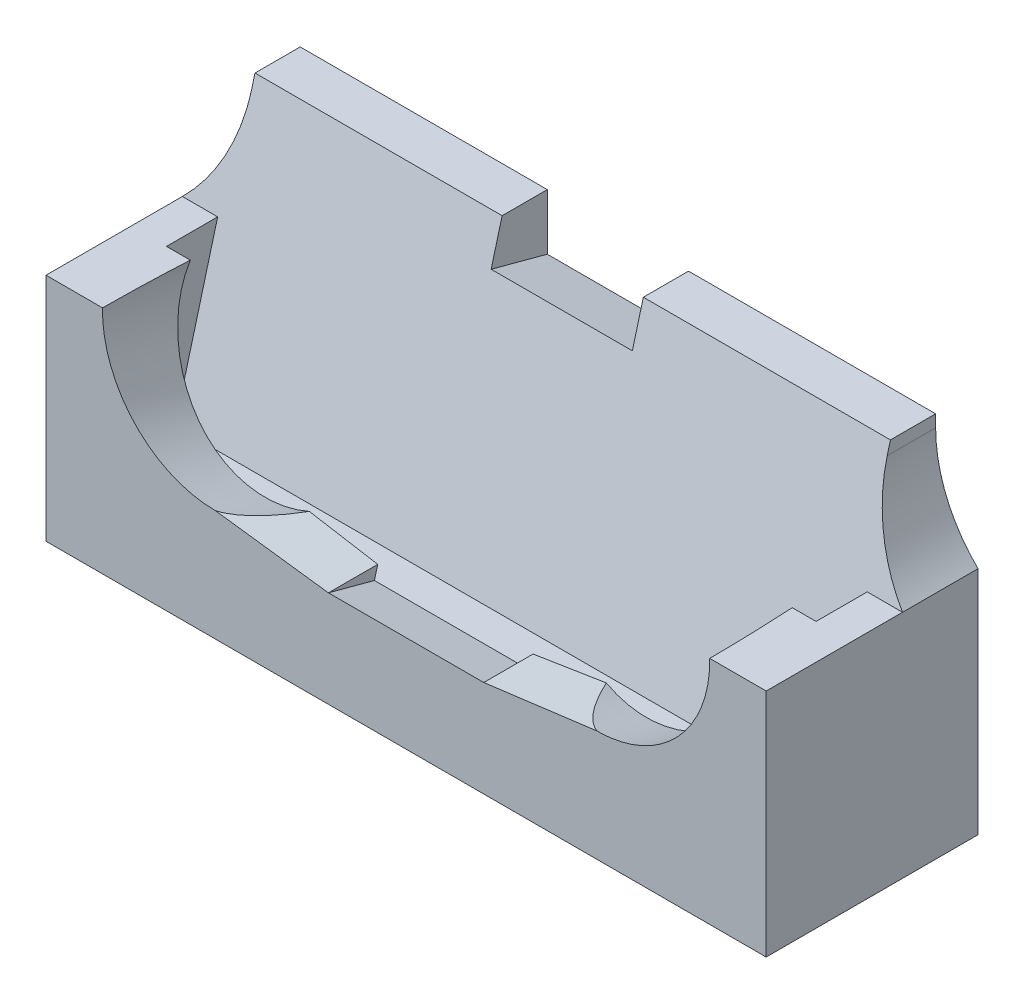
ISO-10303-21;
HEADER;
FILE_DESCRIPTION(('STEP AP214'),'2;1');
FILE_NAME('part.step','',(''),(''),'','','');
FILE_SCHEMA(('AUTOMOTIVE_DESIGN { 1 0 10303 214 1 1 1 1 }'));
ENDSEC;
DATA;
#1=APPLICATION_CONTEXT('core data for automotive mechanical design processes');
#2=APPLICATION_PROTOCOL_DEFINITION('international standard','automotive_design',2000,#1);
#3=PRODUCT_CONTEXT('',#1,'mechanical');
#4=PRODUCT('Part','Part','',(#3));
#5=PRODUCT_RELATED_PRODUCT_CATEGORY('part','',(#4));
#6=PRODUCT_DEFINITION_FORMATION('','',#4);
#7=PRODUCT_DEFINITION_CONTEXT('part definition',#1,'design');
#8=PRODUCT_DEFINITION('design','',#6,#7);
#9=PRODUCT_DEFINITION_SHAPE('','',#8);
#10=(LENGTH_UNIT() NAMED_UNIT(*) SI_UNIT(.MILLI.,.METRE.));
#11=(NAMED_UNIT(*) PLANE_ANGLE_UNIT() SI_UNIT($,.RADIAN.));
#12=(NAMED_UNIT(*) SI_UNIT($,.STERADIAN.) SOLID_ANGLE_UNIT());
#13=UNCERTAINTY_MEASURE_WITH_UNIT(LENGTH_MEASURE(1.E-05),#10,'distance_accuracy_value','');
#14=(GEOMETRIC_REPRESENTATION_CONTEXT(3) GLOBAL_UNCERTAINTY_ASSIGNED_CONTEXT((#13)) GLOBAL_UNIT_ASSIGNED_CONTEXT((#10,
#11,#12)) REPRESENTATION_CONTEXT('',''));
#15=CARTESIAN_POINT('',(0.,0.,0.));
#16=DIRECTION('',(0.,0.,1.));
#17=DIRECTION('',(1.,0.,0.));
#18=AXIS2_PLACEMENT_3D('',#15,#16,#17);
#19=CARTESIAN_POINT('',(-21.375,24.3185165257813,-9.54545454545456));
#20=DIRECTION('',(0.,1.,0.));
#21=DIRECTION('',(0.,0.,1.));
#22=AXIS2_PLACEMENT_3D('',#19,#20,#21);
#23=PLANE('',#22);
#24=DIRECTION('',(0.,0.,1.));
#25=VECTOR('',#24,1.);
#26=CARTESIAN_POINT('',(-3.87499999999952,24.3185165257813,-9.54545454545456));
#27=LINE('',#26,#25);
#28=CARTESIAN_POINT('',(-3.87499999999952,24.3185165257813,-9.54545454545456));
#29=VERTEX_POINT('',#28);
#30=CARTESIAN_POINT('',(-3.87499999999952,24.3185165257813,-6.34530207894035));
#31=VERTEX_POINT('',#30);
#32=EDGE_CURVE('E373',#29,#31,#27,.T.);
#33=ORIENTED_EDGE('',*,*,#32,.F.);
#34=DIRECTION('',(1.,0.,0.));
#35=VECTOR('',#34,1.);
#36=CARTESIAN_POINT('',(-21.375,24.3185165257813,-9.54545454545456));
#37=LINE('',#36,#35);
#38=CARTESIAN_POINT('',(-21.375,24.3185165257813,-9.54545454545456));
#39=VERTEX_POINT('',#38);
#40=EDGE_CURVE('E308',#39,#29,#37,.T.);
#41=ORIENTED_EDGE('',*,*,#40,.F.);
#42=DIRECTION('',(0.,0.,1.));
#43=VECTOR('',#42,1.);
#44=CARTESIAN_POINT('',(-21.375,24.3185165257813,-9.54545454545456));
#45=LINE('',#44,#43);
#46=CARTESIAN_POINT('',(-21.375,24.3185165257813,-6.34530207894035));
#47=VERTEX_POINT('',#46);
#48=EDGE_CURVE('E207',#39,#47,#45,.T.);
#49=ORIENTED_EDGE('',*,*,#48,.T.);
#50=DIRECTION('',(1.,0.,0.));
#51=VECTOR('',#50,1.);
#52=CARTESIAN_POINT('',(-21.375,24.3185165257813,-6.34530207894035));
#53=LINE('',#52,#51);
#54=EDGE_CURVE('E332',#47,#31,#53,.T.);
#55=ORIENTED_EDGE('',*,*,#54,.T.);
#56=EDGE_LOOP('',(#33,#41,#49,#55));
#57=FACE_BOUND('',#56,.T.);
#58=ADVANCED_FACE('F37',(#57),#23,.T.);
#59=CARTESIAN_POINT('',(23.625,5.,-9.54545454545454));
#60=DIRECTION('',(-1.,0.,0.));
#61=DIRECTION('',(0.,0.,1.));
#62=AXIS2_PLACEMENT_3D('',#59,#60,#61);
#63=PLANE('',#62);
#64=DIRECTION('',(0.,-0.965925826289067,0.258819045102525));
#65=VECTOR('',#64,1.);
#66=CARTESIAN_POINT('',(23.625,5.,-1.16892117688984));
#67=LINE('',#66,#65);
#68=CARTESIAN_POINT('',(23.625,24.3185165257813,-6.34530207894033));
#69=VERTEX_POINT('',#68);
#70=CARTESIAN_POINT('',(23.625,23.4599449543242,-6.11524851972406));
#71=VERTEX_POINT('',#70);
#72=EDGE_CURVE('E316',#69,#71,#67,.T.);
#73=ORIENTED_EDGE('',*,*,#72,.T.);
#74=DIRECTION('',(0.,0.,1.));
#75=VECTOR('',#74,1.);
#76=CARTESIAN_POINT('',(23.625,23.4599449543242,-9.54545454545454));
#77=LINE('',#76,#75);
#78=CARTESIAN_POINT('',(23.625,23.4599449543242,-9.54545454545454));
#79=VERTEX_POINT('',#78);
#80=EDGE_CURVE('E58',#71,#79,#77,.F.);
#81=ORIENTED_EDGE('',*,*,#80,.T.);
#82=DIRECTION('',(0.,-1.,0.));
#83=VECTOR('',#82,1.);
#84=CARTESIAN_POINT('',(23.625,5.,-9.54545454545454));
#85=LINE('',#84,#83);
#86=CARTESIAN_POINT('',(23.625,24.3185165257813,-9.54545454545454));
#87=VERTEX_POINT('',#86);
#88=EDGE_CURVE('E305',#87,#79,#85,.T.);
#89=ORIENTED_EDGE('',*,*,#88,.F.);
#90=DIRECTION('',(0.,0.,1.));
#91=VECTOR('',#90,1.);
#92=CARTESIAN_POINT('',(23.625,24.3185165257813,-9.54545454545454));
#93=LINE('',#92,#91);
#94=EDGE_CURVE('E319',#87,#69,#93,.T.);
#95=ORIENTED_EDGE('',*,*,#94,.T.);
#96=EDGE_LOOP('',(#73,#81,#89,#95));
#97=FACE_BOUND('',#96,.T.);
#98=ADVANCED_FACE('F424',(#97),#63,.F.);
#99=CARTESIAN_POINT('',(-21.375,5.,-9.54545454545454));
#100=DIRECTION('',(1.,0.,0.));
#101=DIRECTION('',(0.,0.,-1.));
#102=AXIS2_PLACEMENT_3D('',#99,#100,#101);
#103=PLANE('',#102);
#104=DIRECTION('',(0.,-1.,0.));
#105=VECTOR('',#104,1.);
#106=CARTESIAN_POINT('',(-21.375,5.,-9.54545454545454));
#107=LINE('',#106,#105);
#108=CARTESIAN_POINT('',(-21.375,23.4599449543242,-9.54545454545454));
#109=VERTEX_POINT('',#108);
#110=EDGE_CURVE('E309',#39,#109,#107,.T.);
#111=ORIENTED_EDGE('',*,*,#110,.T.);
#112=DIRECTION('',(0.,0.,1.));
#113=VECTOR('',#112,1.);
#114=CARTESIAN_POINT('',(-21.375,23.4599449543242,-9.54545454545454));
#115=LINE('',#114,#113);
#116=CARTESIAN_POINT('',(-21.375,23.4599449543242,-6.11524851972408));
#117=VERTEX_POINT('',#116);
#118=EDGE_CURVE('E377',#109,#117,#115,.T.);
#119=ORIENTED_EDGE('',*,*,#118,.T.);
#120=DIRECTION('',(0.,-0.965925826289067,0.258819045102525));
#121=VECTOR('',#120,1.);
#122=CARTESIAN_POINT('',(-21.375,5.,-1.16892117688986));
#123=LINE('',#122,#121);
#124=EDGE_CURVE('E208',#47,#117,#123,.T.);
#125=ORIENTED_EDGE('',*,*,#124,.F.);
#126=ORIENTED_EDGE('',*,*,#48,.F.);
#127=EDGE_LOOP('',(#111,#119,#125,#126));
#128=FACE_BOUND('',#127,.T.);
#129=ADVANCED_FACE('F404',(#128),#103,.F.);
#130=CARTESIAN_POINT('',(-12.375,17.2474487139159,9.52561326641087));
#131=DIRECTION('',(0.,-0.258819045102525,-0.965925826289067));
#132=DIRECTION('',(0.,0.965925826289067,-0.258819045102525));
#133=AXIS2_PLACEMENT_3D('',#130,#131,#132);
#134=CYLINDRICAL_SURFACE('',#133,8.);
#135=CARTESIAN_POINT('',(-12.375,16.1566093813942,5.45454545454545));
#136=DIRECTION('',(0.,0.,-1.));
#137=DIRECTION('',(0.,-1.,0.));
#138=AXIS2_PLACEMENT_3D('',#135,#136,#137);
#139=ELLIPSE('',#138,8.28220944328067,8.);
#140=CARTESIAN_POINT('',(-12.375,7.87439993811355,5.45454545454545));
#141=VERTEX_POINT('',#140);
#142=CARTESIAN_POINT('',(-20.3734712337107,16.3185165257813,5.45454545454545));
#143=VERTEX_POINT('',#142);
#144=EDGE_CURVE('E320',#141,#143,#139,.T.);
#145=ORIENTED_EDGE('',*,*,#144,.F.);
#146=CARTESIAN_POINT('',(-12.375,7.87439993811355,-25.4550809867043));
#147=DIRECTION('',(-0.128339346206567,-0.99173031223981,0.));
#148=DIRECTION('',(0.0340838954082749,-0.00441078063147196,-0.99940924204653));
#149=AXIS2_PLACEMENT_3D('',#146,#147,#148);
#150=ELLIPSE('',#149,31.1673708666227,8.);
#151=CARTESIAN_POINT('',(-9.39348541337638,7.48856355897898,1.78773685860349));
#152=VERTEX_POINT('',#151);
#153=EDGE_CURVE('E294',#141,#152,#150,.F.);
#154=ORIENTED_EDGE('',*,*,#153,.T.);
#155=CARTESIAN_POINT('',(-12.375,14.6592582628907,-0.133644996479807));
#156=DIRECTION('',(0.,-0.258819045102525,-0.965925826289067));
#157=DIRECTION('',(0.,0.965925826289067,-0.258819045102525));
#158=AXIS2_PLACEMENT_3D('',#155,#156,#157);
#159=CIRCLE('',#158,8.);
#160=CARTESIAN_POINT('',(-20.1883984669442,16.3185165257813,-0.578241908056033));
#161=VERTEX_POINT('',#160);
#162=EDGE_CURVE('E304',#152,#161,#159,.T.);
#163=ORIENTED_EDGE('',*,*,#162,.T.);
#164=CARTESIAN_POINT('',(-12.375,16.3185165257813,6.05879114350643));
#165=DIRECTION('',(0.,-1.,0.));
#166=DIRECTION('',(0.,0.,-1.));
#167=AXIS2_PLACEMENT_3D('',#164,#165,#166);
#168=ELLIPSE('',#167,30.9096264412497,8.);
#169=EDGE_CURVE('E322',#161,#143,#168,.F.);
#170=ORIENTED_EDGE('',*,*,#169,.T.);
#171=EDGE_LOOP('',(#145,#154,#163,#170));
#172=FACE_BOUND('',#171,.T.);
#173=ADVANCED_FACE('F446',(#172),#134,.F.);
#174=CARTESIAN_POINT('',(0.,5.,0.));
#175=DIRECTION('',(0.,1.,0.));
#176=DIRECTION('',(0.,0.,1.));
#177=AXIS2_PLACEMENT_3D('',#174,#175,#176);
#178=PLANE('',#177);
#179=DIRECTION('',(1.,0.,0.));
#180=VECTOR('',#179,1.);
#181=CARTESIAN_POINT('',(-21.375,5.,-1.16892117688986));
#182=LINE('',#181,#180);
#183=CARTESIAN_POINT('',(-21.875,5.,-1.16892117688986));
#184=VERTEX_POINT('',#183);
#185=CARTESIAN_POINT('',(24.125,5.,-1.16892117688984));
#186=VERTEX_POINT('',#185);
#187=EDGE_CURVE('E196',#184,#186,#182,.T.);
#188=ORIENTED_EDGE('',*,*,#187,.F.);
#189=DIRECTION('',(0.,0.,-1.));
#190=VECTOR('',#189,1.);
#191=CARTESIAN_POINT('',(-21.875,5.,-1.16892117688986));
#192=LINE('',#191,#190);
#193=CARTESIAN_POINT('',(-21.875,5.,2.45454545454543));
#194=VERTEX_POINT('',#193);
#195=EDGE_CURVE('E230',#194,#184,#192,.T.);
#196=ORIENTED_EDGE('',*,*,#195,.F.);
#197=DIRECTION('',(1.,0.,0.));
#198=VECTOR('',#197,1.);
#199=CARTESIAN_POINT('',(-21.375,5.,2.45454545454543));
#200=LINE('',#199,#198);
#201=CARTESIAN_POINT('',(24.125,5.,2.45454545454544));
#202=VERTEX_POINT('',#201);
#203=EDGE_CURVE('E213',#194,#202,#200,.T.);
#204=ORIENTED_EDGE('',*,*,#203,.T.);
#205=DIRECTION('',(0.,0.,1.));
#206=VECTOR('',#205,1.);
#207=CARTESIAN_POINT('',(24.125,5.,2.45454545454544));
#208=LINE('',#207,#206);
#209=EDGE_CURVE('E211',#186,#202,#208,.T.);
#210=ORIENTED_EDGE('',*,*,#209,.F.);
#211=EDGE_LOOP('',(#188,#196,#204,#210));
#212=FACE_BOUND('',#211,.T.);
#213=ADVANCED_FACE('F212',(#212),#178,.T.);
#214=CARTESIAN_POINT('',(-21.375,5.,5.45454545454545));
#215=DIRECTION('',(0.,0.,-1.));
#216=DIRECTION('',(-1.,0.,0.));
#217=AXIS2_PLACEMENT_3D('',#214,#215,#216);
#218=PLANE('',#217);
#219=DIRECTION('',(-1.,0.,0.));
#220=VECTOR('',#219,1.);
#221=CARTESIAN_POINT('',(-21.375,6.83912375770347,5.45454545454545));
#222=LINE('',#221,#220);
#223=CARTESIAN_POINT('',(6.625,6.83912375770347,5.45454545454545));
#224=VERTEX_POINT('',#223);
#225=CARTESIAN_POINT('',(-4.375,6.83912375770347,5.45454545454546));
#226=VERTEX_POINT('',#225);
#227=EDGE_CURVE('E338',#224,#226,#222,.T.);
#228=ORIENTED_EDGE('',*,*,#227,.T.);
#229=DIRECTION('',(0.99173031223981,-0.128339346206567,0.));
#230=VECTOR('',#229,1.);
#231=CARTESIAN_POINT('',(-12.375,7.87439993811355,5.45454545454545));
#232=LINE('',#231,#230);
#233=EDGE_CURVE('E283',#141,#226,#232,.T.);
#234=ORIENTED_EDGE('',*,*,#233,.F.);
#235=ORIENTED_EDGE('',*,*,#144,.T.);
#236=DIRECTION('',(1.,0.,0.));
#237=VECTOR('',#236,1.);
#238=CARTESIAN_POINT('',(-21.375,16.3185165257813,5.45454545454545));
#239=LINE('',#238,#237);
#240=CARTESIAN_POINT('',(-24.375,16.3185165257813,5.45454545454546));
#241=VERTEX_POINT('',#240);
#242=EDGE_CURVE('E359',#241,#143,#239,.T.);
#243=ORIENTED_EDGE('',*,*,#242,.F.);
#244=DIRECTION('',(0.,1.,0.));
#245=VECTOR('',#244,1.);
#246=CARTESIAN_POINT('',(-24.375,16.3185165257813,5.45454545454546));
#247=LINE('',#246,#245);
#248=CARTESIAN_POINT('',(-24.375,0.,5.45454545454546));
#249=VERTEX_POINT('',#248);
#250=EDGE_CURVE('E270',#249,#241,#247,.T.);
#251=ORIENTED_EDGE('',*,*,#250,.F.);
#252=DIRECTION('',(1.,0.,0.));
#253=VECTOR('',#252,1.);
#254=CARTESIAN_POINT('',(-21.375,0.,5.45454545454545));
#255=LINE('',#254,#253);
#256=CARTESIAN_POINT('',(26.625,0.,5.45454545454546));
#257=VERTEX_POINT('',#256);
#258=EDGE_CURVE('E317',#249,#257,#255,.T.);
#259=ORIENTED_EDGE('',*,*,#258,.T.);
#260=DIRECTION('',(0.,-1.,0.));
#261=VECTOR('',#260,1.);
#262=CARTESIAN_POINT('',(26.625,16.3185165257813,5.45454545454546));
#263=LINE('',#262,#261);
#264=CARTESIAN_POINT('',(26.625,16.3185165257813,5.45454545454546));
#265=VERTEX_POINT('',#264);
#266=EDGE_CURVE('E257',#265,#257,#263,.T.);
#267=ORIENTED_EDGE('',*,*,#266,.F.);
#268=CARTESIAN_POINT('',(22.6234712337107,16.3185165257813,5.45454545454545));
#269=VERTEX_POINT('',#268);
#270=EDGE_CURVE('E345',#269,#265,#239,.T.);
#271=ORIENTED_EDGE('',*,*,#270,.F.);
#272=CARTESIAN_POINT('',(14.625,16.1566093813942,5.45454545454545));
#273=DIRECTION('',(0.,0.,-1.));
#274=DIRECTION('',(0.,-1.,0.));
#275=AXIS2_PLACEMENT_3D('',#272,#273,#274);
#276=ELLIPSE('',#275,8.28220944328067,8.);
#277=CARTESIAN_POINT('',(14.625,7.87439993811356,5.45454545454545));
#278=VERTEX_POINT('',#277);
#279=EDGE_CURVE('E312',#269,#278,#276,.T.);
#280=ORIENTED_EDGE('',*,*,#279,.T.);
#281=DIRECTION('',(0.99173031223981,0.128339346206566,0.));
#282=VECTOR('',#281,1.);
#283=CARTESIAN_POINT('',(6.625,6.83912375770347,5.45454545454545));
#284=LINE('',#283,#282);
#285=EDGE_CURVE('E284',#224,#278,#284,.T.);
#286=ORIENTED_EDGE('',*,*,#285,.F.);
#287=EDGE_LOOP('',(#228,#234,#235,#243,#251,#259,#267,#271,#280,#286));
#288=FACE_BOUND('',#287,.T.);
#289=ADVANCED_FACE('F439',(#288),#218,.F.);
#290=CARTESIAN_POINT('',(-21.375,5.,-9.54545454545454));
#291=DIRECTION('',(0.,0.,1.));
#292=DIRECTION('',(1.,0.,0.));
#293=AXIS2_PLACEMENT_3D('',#290,#291,#292);
#294=PLANE('',#293);
#295=ORIENTED_EDGE('',*,*,#40,.T.);
#296=DIRECTION('',(0.,-1.,0.));
#297=VECTOR('',#296,1.);
#298=CARTESIAN_POINT('',(-3.87499999999951,5.,-9.54545454545454));
#299=LINE('',#298,#297);
#300=CARTESIAN_POINT('',(-3.87499999999952,20.3552097154921,-9.54545454545454));
#301=VERTEX_POINT('',#300);
#302=EDGE_CURVE('E251',#29,#301,#299,.T.);
#303=ORIENTED_EDGE('',*,*,#302,.T.);
#304=DIRECTION('',(1.,0.,0.));
#305=VECTOR('',#304,1.);
#306=CARTESIAN_POINT('',(-21.375,20.3552097154921,-9.54545454545454));
#307=LINE('',#306,#305);
#308=CARTESIAN_POINT('',(6.12500000000002,20.3552097154921,-9.54545454545454));
#309=VERTEX_POINT('',#308);
#310=EDGE_CURVE('E254',#301,#309,#307,.T.);
#311=ORIENTED_EDGE('',*,*,#310,.T.);
#312=DIRECTION('',(0.,1.,0.));
#313=VECTOR('',#312,1.);
#314=CARTESIAN_POINT('',(6.12500000000002,5.00000000000001,-9.54545454545454));
#315=LINE('',#314,#313);
#316=CARTESIAN_POINT('',(6.12500000000002,24.3185165257813,-9.54545454545456));
#317=VERTEX_POINT('',#316);
#318=EDGE_CURVE('E247',#309,#317,#315,.T.);
#319=ORIENTED_EDGE('',*,*,#318,.T.);
#320=EDGE_CURVE('E315',#317,#87,#37,.T.);
#321=ORIENTED_EDGE('',*,*,#320,.T.);
#322=ORIENTED_EDGE('',*,*,#88,.T.);
#323=CARTESIAN_POINT('',(33.625,23.4599449543242,-9.54545454545454));
#324=DIRECTION('',(0.,0.,1.));
#325=DIRECTION('',(1.,0.,0.));
#326=AXIS2_PLACEMENT_3D('',#323,#324,#325);
#327=CIRCLE('',#326,10.);
#328=CARTESIAN_POINT('',(26.625,16.3185165257813,-9.54545454545454));
#329=VERTEX_POINT('',#328);
#330=EDGE_CURVE('E11',#79,#329,#327,.T.);
#331=ORIENTED_EDGE('',*,*,#330,.T.);
#332=DIRECTION('',(0.,1.,0.));
#333=VECTOR('',#332,1.);
#334=CARTESIAN_POINT('',(26.625,16.3185165257813,-9.54545454545454));
#335=LINE('',#334,#333);
#336=CARTESIAN_POINT('',(26.625,0.,-9.54545454545454));
#337=VERTEX_POINT('',#336);
#338=EDGE_CURVE('E263',#337,#329,#335,.T.);
#339=ORIENTED_EDGE('',*,*,#338,.F.);
#340=DIRECTION('',(-1.,0.,0.));
#341=VECTOR('',#340,1.);
#342=CARTESIAN_POINT('',(-21.375,0.,-9.54545454545454));
#343=LINE('',#342,#341);
#344=CARTESIAN_POINT('',(-24.375,0.,-9.54545454545454));
#345=VERTEX_POINT('',#344);
#346=EDGE_CURVE('E313',#337,#345,#343,.T.);
#347=ORIENTED_EDGE('',*,*,#346,.T.);
#348=DIRECTION('',(0.,-1.,0.));
#349=VECTOR('',#348,1.);
#350=CARTESIAN_POINT('',(-24.375,16.3185165257813,-9.54545454545455));
#351=LINE('',#350,#349);
#352=CARTESIAN_POINT('',(-24.375,16.3185165257813,-9.54545454545455));
#353=VERTEX_POINT('',#352);
#354=EDGE_CURVE('E277',#353,#345,#351,.T.);
#355=ORIENTED_EDGE('',*,*,#354,.F.);
#356=CARTESIAN_POINT('',(-31.375,23.4599449543242,-9.54545454545454));
#357=DIRECTION('',(0.,0.,1.));
#358=DIRECTION('',(1.,0.,0.));
#359=AXIS2_PLACEMENT_3D('',#356,#357,#358);
#360=CIRCLE('',#359,10.);
#361=EDGE_CURVE('E382',#353,#109,#360,.T.);
#362=ORIENTED_EDGE('',*,*,#361,.T.);
#363=ORIENTED_EDGE('',*,*,#110,.F.);
#364=EDGE_LOOP('',(#295,#303,#311,#319,#321,#322,#331,#339,#347,#355,#362,#363));
#365=FACE_BOUND('',#364,.T.);
#366=ADVANCED_FACE('F400',(#365),#294,.F.);
#367=CARTESIAN_POINT('',(0.,0.,0.));
#368=DIRECTION('',(0.,1.,0.));
#369=DIRECTION('',(0.,0.,1.));
#370=AXIS2_PLACEMENT_3D('',#367,#368,#369);
#371=PLANE('',#370);
#372=ORIENTED_EDGE('',*,*,#258,.F.);
#373=DIRECTION('',(0.,0.,1.));
#374=VECTOR('',#373,1.);
#375=CARTESIAN_POINT('',(-24.375,0.,5.45454545454546));
#376=LINE('',#375,#374);
#377=EDGE_CURVE('E280',#345,#249,#376,.T.);
#378=ORIENTED_EDGE('',*,*,#377,.F.);
#379=ORIENTED_EDGE('',*,*,#346,.F.);
#380=DIRECTION('',(0.,0.,-1.));
#381=VECTOR('',#380,1.);
#382=CARTESIAN_POINT('',(26.625,0.,5.45454545454546));
#383=LINE('',#382,#381);
#384=EDGE_CURVE('E260',#257,#337,#383,.T.);
#385=ORIENTED_EDGE('',*,*,#384,.F.);
#386=EDGE_LOOP('',(#372,#378,#379,#385));
#387=FACE_BOUND('',#386,.T.);
#388=ADVANCED_FACE('F436',(#387),#371,.F.);
#389=CARTESIAN_POINT('',(-21.375,5.,2.45454545454543));
#390=DIRECTION('',(0.,-0.258819045102525,-0.965925826289067));
#391=DIRECTION('',(0.,0.965925826289067,-0.258819045102525));
#392=AXIS2_PLACEMENT_3D('',#389,#390,#391);
#393=PLANE('',#392);
#394=DIRECTION('',(0.991144439670157,-0.128263528717052,0.0343681089381012));
#395=VECTOR('',#394,1.);
#396=CARTESIAN_POINT('',(-13.4143521489633,8.00890200347353,1.6483125926103));
#397=LINE('',#396,#395);
#398=CARTESIAN_POINT('',(-4.375,6.83912375770347,1.96175372888789));
#399=VERTEX_POINT('',#398);
#400=EDGE_CURVE('E286',#152,#399,#397,.T.);
#401=ORIENTED_EDGE('',*,*,#400,.T.);
#402=DIRECTION('',(0.,0.965925826289067,-0.258819045102525));
#403=VECTOR('',#402,1.);
#404=CARTESIAN_POINT('',(-4.375,5.96592582628907,2.19572640944292));
#405=LINE('',#404,#403);
#406=CARTESIAN_POINT('',(-4.375,5.96592582628907,2.19572640944292));
#407=VERTEX_POINT('',#406);
#408=EDGE_CURVE('E348',#407,#399,#405,.T.);
#409=ORIENTED_EDGE('',*,*,#408,.F.);
#410=DIRECTION('',(-1.,0.,0.));
#411=VECTOR('',#410,1.);
#412=CARTESIAN_POINT('',(6.625,5.96592582628907,2.19572640944292));
#413=LINE('',#412,#411);
#414=CARTESIAN_POINT('',(6.625,5.96592582628907,2.19572640944292));
#415=VERTEX_POINT('',#414);
#416=EDGE_CURVE('E344',#415,#407,#413,.T.);
#417=ORIENTED_EDGE('',*,*,#416,.F.);
#418=DIRECTION('',(0.,-0.965925826289067,0.258819045102525));
#419=VECTOR('',#418,1.);
#420=CARTESIAN_POINT('',(6.625,5.96592582628907,2.19572640944292));
#421=LINE('',#420,#419);
#422=CARTESIAN_POINT('',(6.625,6.83912375770347,1.9617537288879));
#423=VERTEX_POINT('',#422);
#424=EDGE_CURVE('E349',#423,#415,#421,.T.);
#425=ORIENTED_EDGE('',*,*,#424,.F.);
#426=DIRECTION('',(0.991144439670157,0.128263528717051,-0.0343681089381001));
#427=VECTOR('',#426,1.);
#428=CARTESIAN_POINT('',(7.67380148425915,6.9748486570325,1.92538635171989));
#429=LINE('',#428,#427);
#430=CARTESIAN_POINT('',(11.6434854133764,7.48856355897898,1.7877368586035));
#431=VERTEX_POINT('',#430);
#432=EDGE_CURVE('E291',#423,#431,#429,.T.);
#433=ORIENTED_EDGE('',*,*,#432,.T.);
#434=CARTESIAN_POINT('',(14.625,14.6592582628907,-0.133644996479797));
#435=DIRECTION('',(0.,-0.258819045102525,-0.965925826289067));
#436=DIRECTION('',(0.,0.965925826289067,-0.258819045102525));
#437=AXIS2_PLACEMENT_3D('',#434,#435,#436);
#438=CIRCLE('',#437,8.);
#439=CARTESIAN_POINT('',(22.4383984669442,16.3185165257813,-0.578241908056014));
#440=VERTEX_POINT('',#439);
#441=EDGE_CURVE('E335',#440,#431,#438,.T.);
#442=ORIENTED_EDGE('',*,*,#441,.F.);
#443=DIRECTION('',(1.,0.,0.));
#444=VECTOR('',#443,1.);
#445=CARTESIAN_POINT('',(-21.375,16.3185165257813,-0.578241908056033));
#446=LINE('',#445,#444);
#447=CARTESIAN_POINT('',(24.125,16.3185165257813,-0.578241908056019));
#448=VERTEX_POINT('',#447);
#449=EDGE_CURVE('E307',#440,#448,#446,.T.);
#450=ORIENTED_EDGE('',*,*,#449,.T.);
#451=DIRECTION('',(0.,0.965925826289067,-0.258819045102524));
#452=VECTOR('',#451,1.);
#453=CARTESIAN_POINT('',(24.125,16.3185165257813,-0.578241908056019));
#454=LINE('',#453,#452);
#455=EDGE_CURVE('E217',#202,#448,#454,.T.);
#456=ORIENTED_EDGE('',*,*,#455,.F.);
#457=ORIENTED_EDGE('',*,*,#203,.F.);
#458=DIRECTION('',(0.,-0.965925826289067,0.258819045102525));
#459=VECTOR('',#458,1.);
#460=CARTESIAN_POINT('',(-21.875,5.,2.45454545454543));
#461=LINE('',#460,#459);
#462=CARTESIAN_POINT('',(-21.875,16.3185165257813,-0.578241908056033));
#463=VERTEX_POINT('',#462);
#464=EDGE_CURVE('E227',#463,#194,#461,.T.);
#465=ORIENTED_EDGE('',*,*,#464,.F.);
#466=EDGE_CURVE('E328',#463,#161,#446,.T.);
#467=ORIENTED_EDGE('',*,*,#466,.T.);
#468=ORIENTED_EDGE('',*,*,#162,.F.);
#469=EDGE_LOOP('',(#401,#409,#417,#425,#433,#442,#450,#456,#457,#465,#467,#468));
#470=FACE_BOUND('',#469,.T.);
#471=ADVANCED_FACE('F449',(#470),#393,.T.);
#472=CARTESIAN_POINT('',(-21.375,5.,-1.16892117688986));
#473=DIRECTION('',(0.,0.258819045102525,0.965925826289067));
#474=DIRECTION('',(0.,-0.965925826289067,0.258819045102525));
#475=AXIS2_PLACEMENT_3D('',#472,#473,#474);
#476=PLANE('',#475);
#477=DIRECTION('',(-1.,0.,0.));
#478=VECTOR('',#477,1.);
#479=CARTESIAN_POINT('',(-21.375,16.3185165257813,-4.20170853949133));
#480=LINE('',#479,#478);
#481=CARTESIAN_POINT('',(-21.875,16.3185165257813,-4.20170853949133));
#482=VERTEX_POINT('',#481);
#483=CARTESIAN_POINT('',(-24.375,16.3185165257813,-4.20170853949133));
#484=VERTEX_POINT('',#483);
#485=EDGE_CURVE('E375',#482,#484,#480,.T.);
#486=ORIENTED_EDGE('',*,*,#485,.F.);
#487=DIRECTION('',(0.,0.965925826289067,-0.258819045102525));
#488=VECTOR('',#487,1.);
#489=CARTESIAN_POINT('',(-21.875,16.3185165257813,-4.20170853949133));
#490=LINE('',#489,#488);
#491=EDGE_CURVE('E203',#184,#482,#490,.T.);
#492=ORIENTED_EDGE('',*,*,#491,.F.);
#493=ORIENTED_EDGE('',*,*,#187,.T.);
#494=DIRECTION('',(0.,-0.965925826289067,0.258819045102524));
#495=VECTOR('',#494,1.);
#496=CARTESIAN_POINT('',(24.125,5.,-1.16892117688984));
#497=LINE('',#496,#495);
#498=CARTESIAN_POINT('',(24.125,16.3185165257813,-4.20170853949131));
#499=VERTEX_POINT('',#498);
#500=EDGE_CURVE('E201',#499,#186,#497,.T.);
#501=ORIENTED_EDGE('',*,*,#500,.F.);
#502=DIRECTION('',(-1.,0.,0.));
#503=VECTOR('',#502,1.);
#504=CARTESIAN_POINT('',(-21.375,16.3185165257813,-4.20170853949133));
#505=LINE('',#504,#503);
#506=CARTESIAN_POINT('',(26.625,16.3185165257813,-4.20170853949131));
#507=VERTEX_POINT('',#506);
#508=EDGE_CURVE('E379',#507,#499,#505,.T.);
#509=ORIENTED_EDGE('',*,*,#508,.F.);
#510=CARTESIAN_POINT('',(33.625,23.4599449543242,-6.11524851972405));
#511=DIRECTION('',(0.,0.258819045102525,0.965925826289067));
#512=DIRECTION('',(0.,-0.965925826289067,0.258819045102525));
#513=AXIS2_PLACEMENT_3D('',#510,#511,#512);
#514=ELLIPSE('',#513,10.3527618041008,10.);
#515=EDGE_CURVE('E45',#507,#71,#514,.F.);
#516=ORIENTED_EDGE('',*,*,#515,.T.);
#517=ORIENTED_EDGE('',*,*,#72,.F.);
#518=CARTESIAN_POINT('',(6.12500000000001,24.3185165257813,-6.34530207894034));
#519=VERTEX_POINT('',#518);
#520=EDGE_CURVE('E325',#519,#69,#53,.T.);
#521=ORIENTED_EDGE('',*,*,#520,.F.);
#522=DIRECTION('',(0.,0.965925826289067,-0.258819045102525));
#523=VECTOR('',#522,1.);
#524=CARTESIAN_POINT('',(6.12500000000001,28.8383024555971,-7.55637506879605));
#525=LINE('',#524,#523);
#526=CARTESIAN_POINT('',(6.12500000000001,21.4207390469141,-5.56884494363277));
#527=VERTEX_POINT('',#526);
#528=EDGE_CURVE('E242',#527,#519,#525,.T.);
#529=ORIENTED_EDGE('',*,*,#528,.F.);
#530=DIRECTION('',(1.,0.,0.));
#531=VECTOR('',#530,1.);
#532=CARTESIAN_POINT('',(-3.87499999999952,21.4207390469141,-5.56884494363277));
#533=LINE('',#532,#531);
#534=CARTESIAN_POINT('',(-3.87499999999952,21.4207390469141,-5.56884494363277));
#535=VERTEX_POINT('',#534);
#536=EDGE_CURVE('E239',#535,#527,#533,.T.);
#537=ORIENTED_EDGE('',*,*,#536,.F.);
#538=DIRECTION('',(0.,-0.965925826289067,0.258819045102525));
#539=VECTOR('',#538,1.);
#540=CARTESIAN_POINT('',(-3.87499999999952,28.8383024555971,-7.55637506879605));
#541=LINE('',#540,#539);
#542=EDGE_CURVE('E236',#31,#535,#541,.T.);
#543=ORIENTED_EDGE('',*,*,#542,.F.);
#544=ORIENTED_EDGE('',*,*,#54,.F.);
#545=ORIENTED_EDGE('',*,*,#124,.T.);
#546=CARTESIAN_POINT('',(-31.375,23.4599449543242,-6.11524851972409));
#547=DIRECTION('',(0.,0.258819045102525,0.965925826289067));
#548=DIRECTION('',(0.,-0.965925826289067,0.258819045102525));
#549=AXIS2_PLACEMENT_3D('',#546,#547,#548);
#550=ELLIPSE('',#549,10.3527618041008,10.);
#551=EDGE_CURVE('E384',#117,#484,#550,.F.);
#552=ORIENTED_EDGE('',*,*,#551,.T.);
#553=EDGE_LOOP('',(#486,#492,#493,#501,#509,#516,#517,#521,#529,#537,#543,#544,#545,#552));
#554=FACE_BOUND('',#553,.T.);
#555=ADVANCED_FACE('F199',(#554),#476,.T.);
#556=DIRECTION('',(0.,0.,-1.));
#557=VECTOR('',#556,1.);
#558=CARTESIAN_POINT('',(6.12500000000002,24.3185165257813,-9.54545454545456));
#559=LINE('',#558,#557);
#560=EDGE_CURVE('E363',#519,#317,#559,.T.);
#561=ORIENTED_EDGE('',*,*,#560,.F.);
#562=ORIENTED_EDGE('',*,*,#520,.T.);
#563=ORIENTED_EDGE('',*,*,#94,.F.);
#564=ORIENTED_EDGE('',*,*,#320,.F.);
#565=EDGE_LOOP('',(#561,#562,#563,#564));
#566=FACE_BOUND('',#565,.T.);
#567=ADVANCED_FACE('F422',(#566),#23,.T.);
#568=CARTESIAN_POINT('',(14.625,17.2474487139159,9.52561326641088));
#569=DIRECTION('',(0.,-0.258819045102525,-0.965925826289067));
#570=DIRECTION('',(0.,0.965925826289067,-0.258819045102525));
#571=AXIS2_PLACEMENT_3D('',#568,#569,#570);
#572=CYLINDRICAL_SURFACE('',#571,8.);
#573=ORIENTED_EDGE('',*,*,#441,.T.);
#574=CARTESIAN_POINT('',(14.625,7.87439993811356,-25.4550809867043));
#575=DIRECTION('',(0.128339346206566,-0.99173031223981,0.));
#576=DIRECTION('',(-0.0340838954082739,-0.00441078063147181,-0.99940924204653));
#577=AXIS2_PLACEMENT_3D('',#574,#575,#576);
#578=ELLIPSE('',#577,31.1673708666227,8.);
#579=EDGE_CURVE('E301',#431,#278,#578,.F.);
#580=ORIENTED_EDGE('',*,*,#579,.T.);
#581=ORIENTED_EDGE('',*,*,#279,.F.);
#582=CARTESIAN_POINT('',(14.625,16.3185165257813,6.05879114350643));
#583=DIRECTION('',(0.,-1.,0.));
#584=DIRECTION('',(0.,0.,-1.));
#585=AXIS2_PLACEMENT_3D('',#582,#583,#584);
#586=ELLIPSE('',#585,30.9096264412497,8.);
#587=EDGE_CURVE('E356',#269,#440,#586,.F.);
#588=ORIENTED_EDGE('',*,*,#587,.T.);
#589=EDGE_LOOP('',(#573,#580,#581,#588));
#590=FACE_BOUND('',#589,.T.);
#591=ADVANCED_FACE('F473',(#590),#572,.F.);
#592=CARTESIAN_POINT('',(-21.375,16.3185165257813,-48.1617773404768));
#593=DIRECTION('',(0.,-1.,0.));
#594=DIRECTION('',(0.,0.,-1.));
#595=AXIS2_PLACEMENT_3D('',#592,#593,#594);
#596=PLANE('',#595);
#597=ORIENTED_EDGE('',*,*,#466,.F.);
#598=DIRECTION('',(0.,0.,1.));
#599=VECTOR('',#598,1.);
#600=CARTESIAN_POINT('',(-21.875,16.3185165257813,-0.578241908056033));
#601=LINE('',#600,#599);
#602=EDGE_CURVE('E233',#482,#463,#601,.T.);
#603=ORIENTED_EDGE('',*,*,#602,.F.);
#604=ORIENTED_EDGE('',*,*,#485,.T.);
#605=DIRECTION('',(0.,0.,-1.));
#606=VECTOR('',#605,1.);
#607=CARTESIAN_POINT('',(-24.375,16.3185165257813,5.45454545454546));
#608=LINE('',#607,#606);
#609=EDGE_CURVE('E274',#241,#484,#608,.T.);
#610=ORIENTED_EDGE('',*,*,#609,.F.);
#611=ORIENTED_EDGE('',*,*,#242,.T.);
#612=ORIENTED_EDGE('',*,*,#169,.F.);
#613=EDGE_LOOP('',(#597,#603,#604,#610,#611,#612));
#614=FACE_BOUND('',#613,.T.);
#615=ADVANCED_FACE('F444',(#614),#596,.F.);
#616=DIRECTION('',(0.,0.,-1.));
#617=VECTOR('',#616,1.);
#618=CARTESIAN_POINT('',(24.125,16.3185165257813,-4.20170853949131));
#619=LINE('',#618,#617);
#620=EDGE_CURVE('E221',#448,#499,#619,.T.);
#621=ORIENTED_EDGE('',*,*,#620,.F.);
#622=ORIENTED_EDGE('',*,*,#449,.F.);
#623=ORIENTED_EDGE('',*,*,#587,.F.);
#624=ORIENTED_EDGE('',*,*,#270,.T.);
#625=DIRECTION('',(0.,0.,1.));
#626=VECTOR('',#625,1.);
#627=CARTESIAN_POINT('',(26.625,16.3185165257813,5.45454545454546));
#628=LINE('',#627,#626);
#629=EDGE_CURVE('E266',#507,#265,#628,.T.);
#630=ORIENTED_EDGE('',*,*,#629,.F.);
#631=ORIENTED_EDGE('',*,*,#508,.T.);
#632=EDGE_LOOP('',(#621,#622,#623,#624,#630,#631));
#633=FACE_BOUND('',#632,.T.);
#634=ADVANCED_FACE('F525',(#633),#596,.F.);
#635=CARTESIAN_POINT('',(6.625,7.64824961945548,8.47424428032186));
#636=DIRECTION('',(0.,-0.965925826289067,0.258819045102525));
#637=DIRECTION('',(0.,-0.258819045102525,-0.965925826289067));
#638=AXIS2_PLACEMENT_3D('',#635,#636,#637);
#639=PLANE('',#638);
#640=DIRECTION('',(0.,-0.258819045102525,-0.965925826289067));
#641=VECTOR('',#640,1.);
#642=CARTESIAN_POINT('',(6.625,7.64824961945548,8.47424428032186));
#643=LINE('',#642,#641);
#644=EDGE_CURVE('E341',#224,#415,#643,.T.);
#645=ORIENTED_EDGE('',*,*,#644,.T.);
#646=ORIENTED_EDGE('',*,*,#416,.T.);
#647=DIRECTION('',(0.,-0.258819045102525,-0.965925826289067));
#648=VECTOR('',#647,1.);
#649=CARTESIAN_POINT('',(-4.375,7.64824961945548,8.47424428032186));
#650=LINE('',#649,#648);
#651=EDGE_CURVE('E346',#226,#407,#650,.T.);
#652=ORIENTED_EDGE('',*,*,#651,.F.);
#653=ORIENTED_EDGE('',*,*,#227,.F.);
#654=EDGE_LOOP('',(#645,#646,#652,#653));
#655=FACE_BOUND('',#654,.T.);
#656=ADVANCED_FACE('F527',(#655),#639,.F.);
#657=CARTESIAN_POINT('',(6.625,7.64824961945548,8.47424428032186));
#658=DIRECTION('',(1.,0.,0.));
#659=DIRECTION('',(0.,0.,-1.));
#660=AXIS2_PLACEMENT_3D('',#657,#658,#659);
#661=PLANE('',#660);
#662=ORIENTED_EDGE('',*,*,#644,.F.);
#663=DIRECTION('',(0.,0.,1.));
#664=VECTOR('',#663,1.);
#665=CARTESIAN_POINT('',(6.625,6.83912375770347,-28.8276095686428));
#666=LINE('',#665,#664);
#667=EDGE_CURVE('E295',#423,#224,#666,.T.);
#668=ORIENTED_EDGE('',*,*,#667,.F.);
#669=ORIENTED_EDGE('',*,*,#424,.T.);
#670=EDGE_LOOP('',(#662,#668,#669));
#671=FACE_BOUND('',#670,.T.);
#672=ADVANCED_FACE('F517',(#671),#661,.F.);
#673=CARTESIAN_POINT('',(-4.375,7.64824961945548,8.47424428032186));
#674=DIRECTION('',(-1.,0.,0.));
#675=DIRECTION('',(0.,0.,1.));
#676=AXIS2_PLACEMENT_3D('',#673,#674,#675);
#677=PLANE('',#676);
#678=ORIENTED_EDGE('',*,*,#408,.T.);
#679=DIRECTION('',(0.,0.,1.));
#680=VECTOR('',#679,1.);
#681=CARTESIAN_POINT('',(-4.375,6.83912375770347,-28.8276095686428));
#682=LINE('',#681,#680);
#683=EDGE_CURVE('E290',#399,#226,#682,.T.);
#684=ORIENTED_EDGE('',*,*,#683,.T.);
#685=ORIENTED_EDGE('',*,*,#651,.T.);
#686=EDGE_LOOP('',(#678,#684,#685));
#687=FACE_BOUND('',#686,.T.);
#688=ADVANCED_FACE('F496',(#687),#677,.F.);
#689=CARTESIAN_POINT('',(-12.375,7.87439993811355,-28.8276095686428));
#690=DIRECTION('',(-0.128339346206567,-0.99173031223981,0.));
#691=DIRECTION('',(0.99173031223981,-0.128339346206567,0.));
#692=AXIS2_PLACEMENT_3D('',#689,#690,#691);
#693=PLANE('',#692);
#694=ORIENTED_EDGE('',*,*,#233,.T.);
#695=ORIENTED_EDGE('',*,*,#683,.F.);
#696=ORIENTED_EDGE('',*,*,#400,.F.);
#697=ORIENTED_EDGE('',*,*,#153,.F.);
#698=EDGE_LOOP('',(#694,#695,#696,#697));
#699=FACE_BOUND('',#698,.T.);
#700=ADVANCED_FACE('F492',(#699),#693,.F.);
#701=CARTESIAN_POINT('',(6.625,6.83912375770347,-28.8276095686428));
#702=DIRECTION('',(0.128339346206566,-0.99173031223981,0.));
#703=DIRECTION('',(0.99173031223981,0.128339346206566,0.));
#704=AXIS2_PLACEMENT_3D('',#701,#702,#703);
#705=PLANE('',#704);
#706=ORIENTED_EDGE('',*,*,#432,.F.);
#707=ORIENTED_EDGE('',*,*,#667,.T.);
#708=ORIENTED_EDGE('',*,*,#285,.T.);
#709=ORIENTED_EDGE('',*,*,#579,.F.);
#710=EDGE_LOOP('',(#706,#707,#708,#709));
#711=FACE_BOUND('',#710,.T.);
#712=ADVANCED_FACE('F495',(#711),#705,.F.);
#713=CARTESIAN_POINT('',(-24.375,0.,0.));
#714=DIRECTION('',(1.,0.,0.));
#715=DIRECTION('',(0.,0.,-1.));
#716=AXIS2_PLACEMENT_3D('',#713,#714,#715);
#717=PLANE('',#716);
#718=ORIENTED_EDGE('',*,*,#250,.T.);
#719=ORIENTED_EDGE('',*,*,#609,.T.);
#720=EDGE_CURVE('E273',#484,#353,#608,.T.);
#721=ORIENTED_EDGE('',*,*,#720,.T.);
#722=ORIENTED_EDGE('',*,*,#354,.T.);
#723=ORIENTED_EDGE('',*,*,#377,.T.);
#724=EDGE_LOOP('',(#718,#719,#721,#722,#723));
#725=FACE_BOUND('',#724,.T.);
#726=ADVANCED_FACE('F394',(#725),#717,.F.);
#727=CARTESIAN_POINT('',(26.625,0.,0.));
#728=DIRECTION('',(1.,0.,0.));
#729=DIRECTION('',(0.,0.,-1.));
#730=AXIS2_PLACEMENT_3D('',#727,#728,#729);
#731=PLANE('',#730);
#732=ORIENTED_EDGE('',*,*,#266,.T.);
#733=ORIENTED_EDGE('',*,*,#384,.T.);
#734=ORIENTED_EDGE('',*,*,#338,.T.);
#735=EDGE_CURVE('E267',#329,#507,#628,.T.);
#736=ORIENTED_EDGE('',*,*,#735,.T.);
#737=ORIENTED_EDGE('',*,*,#629,.T.);
#738=EDGE_LOOP('',(#732,#733,#734,#736,#737));
#739=FACE_BOUND('',#738,.T.);
#740=ADVANCED_FACE('F430',(#739),#731,.T.);
#741=CARTESIAN_POINT('',(-3.87499999999952,19.867824776299,-11.3643999013672));
#742=DIRECTION('',(0.,-0.965925826289067,0.258819045102525));
#743=DIRECTION('',(0.,-0.258819045102525,-0.965925826289067));
#744=AXIS2_PLACEMENT_3D('',#741,#742,#743);
#745=PLANE('',#744);
#746=DIRECTION('',(0.,0.258819045102525,0.965925826289067));
#747=VECTOR('',#746,1.);
#748=CARTESIAN_POINT('',(-3.87499999999952,19.867824776299,-11.3643999013672));
#749=LINE('',#748,#747);
#750=EDGE_CURVE('E244',#301,#535,#749,.T.);
#751=ORIENTED_EDGE('',*,*,#750,.T.);
#752=ORIENTED_EDGE('',*,*,#536,.T.);
#753=DIRECTION('',(0.,0.258819045102525,0.965925826289067));
#754=VECTOR('',#753,1.);
#755=CARTESIAN_POINT('',(6.12500000000002,19.867824776299,-11.3643999013672));
#756=LINE('',#755,#754);
#757=EDGE_CURVE('E245',#309,#527,#756,.T.);
#758=ORIENTED_EDGE('',*,*,#757,.F.);
#759=ORIENTED_EDGE('',*,*,#310,.F.);
#760=EDGE_LOOP('',(#751,#752,#758,#759));
#761=FACE_BOUND('',#760,.T.);
#762=ADVANCED_FACE('F413',(#761),#745,.F.);
#763=CARTESIAN_POINT('',(-3.87499999999952,27.285388184982,-13.3519300265305));
#764=DIRECTION('',(-1.,0.,0.));
#765=DIRECTION('',(0.,0.,1.));
#766=AXIS2_PLACEMENT_3D('',#763,#764,#765);
#767=PLANE('',#766);
#768=ORIENTED_EDGE('',*,*,#32,.T.);
#769=ORIENTED_EDGE('',*,*,#542,.T.);
#770=ORIENTED_EDGE('',*,*,#750,.F.);
#771=ORIENTED_EDGE('',*,*,#302,.F.);
#772=EDGE_LOOP('',(#768,#769,#770,#771));
#773=FACE_BOUND('',#772,.T.);
#774=ADVANCED_FACE('F409',(#773),#767,.F.);
#775=CARTESIAN_POINT('',(6.12500000000002,27.285388184982,-13.3519300265305));
#776=DIRECTION('',(1.,0.,0.));
#777=DIRECTION('',(0.,0.,-1.));
#778=AXIS2_PLACEMENT_3D('',#775,#776,#777);
#779=PLANE('',#778);
#780=ORIENTED_EDGE('',*,*,#757,.T.);
#781=ORIENTED_EDGE('',*,*,#528,.T.);
#782=ORIENTED_EDGE('',*,*,#560,.T.);
#783=ORIENTED_EDGE('',*,*,#318,.F.);
#784=EDGE_LOOP('',(#780,#781,#782,#783));
#785=FACE_BOUND('',#784,.T.);
#786=ADVANCED_FACE('F417',(#785),#779,.F.);
#787=CARTESIAN_POINT('',(-31.375,23.4599449543242,-48.1617773404768));
#788=DIRECTION('',(0.,0.,1.));
#789=DIRECTION('',(1.,0.,0.));
#790=AXIS2_PLACEMENT_3D('',#787,#788,#789);
#791=CYLINDRICAL_SURFACE('',#790,10.);
#792=ORIENTED_EDGE('',*,*,#551,.F.);
#793=ORIENTED_EDGE('',*,*,#118,.F.);
#794=ORIENTED_EDGE('',*,*,#361,.F.);
#795=ORIENTED_EDGE('',*,*,#720,.F.);
#796=EDGE_LOOP('',(#792,#793,#794,#795));
#797=FACE_BOUND('',#796,.T.);
#798=ADVANCED_FACE('F398',(#797),#791,.F.);
#799=CARTESIAN_POINT('',(33.625,23.4599449543242,-48.1617773404767));
#800=DIRECTION('',(0.,0.,1.));
#801=DIRECTION('',(1.,0.,0.));
#802=AXIS2_PLACEMENT_3D('',#799,#800,#801);
#803=CYLINDRICAL_SURFACE('',#802,10.);
#804=ORIENTED_EDGE('',*,*,#330,.F.);
#805=ORIENTED_EDGE('',*,*,#80,.F.);
#806=ORIENTED_EDGE('',*,*,#515,.F.);
#807=ORIENTED_EDGE('',*,*,#735,.F.);
#808=EDGE_LOOP('',(#804,#805,#806,#807));
#809=FACE_BOUND('',#808,.T.);
#810=ADVANCED_FACE('F39',(#809),#803,.F.);
#811=CARTESIAN_POINT('',(-21.875,0.,0.));
#812=DIRECTION('',(-1.,0.,0.));
#813=DIRECTION('',(0.,0.,1.));
#814=AXIS2_PLACEMENT_3D('',#811,#812,#813);
#815=PLANE('',#814);
#816=ORIENTED_EDGE('',*,*,#464,.T.);
#817=ORIENTED_EDGE('',*,*,#195,.T.);
#818=ORIENTED_EDGE('',*,*,#491,.T.);
#819=ORIENTED_EDGE('',*,*,#602,.T.);
#820=EDGE_LOOP('',(#816,#817,#818,#819));
#821=FACE_BOUND('',#820,.T.);
#822=ADVANCED_FACE('F454',(#821),#815,.F.);
#823=CARTESIAN_POINT('',(24.125,0.,0.));
#824=DIRECTION('',(1.,0.,0.));
#825=DIRECTION('',(0.,0.,-1.));
#826=AXIS2_PLACEMENT_3D('',#823,#824,#825);
#827=PLANE('',#826);
#828=ORIENTED_EDGE('',*,*,#500,.T.);
#829=ORIENTED_EDGE('',*,*,#209,.T.);
#830=ORIENTED_EDGE('',*,*,#455,.T.);
#831=ORIENTED_EDGE('',*,*,#620,.T.);
#832=EDGE_LOOP('',(#828,#829,#830,#831));
#833=FACE_BOUND('',#832,.T.);
#834=ADVANCED_FACE('F219',(#833),#827,.F.);
#835=CLOSED_SHELL('',(#58,#98,#129,#173,#213,#289,#366,#388,#471,#555,#567,#591,#615,#634,#656,
#672,#688,#700,#712,#726,#740,#762,#774,#786,#798,#810,#822,#834));
#836=MANIFOLD_SOLID_BREP('B2',#835);
#837=ADVANCED_BREP_SHAPE_REPRESENTATION('',(#18,#836),#14);
#838=SHAPE_DEFINITION_REPRESENTATION(#9,#837);
ENDSEC;
END-ISO-10303-21;
